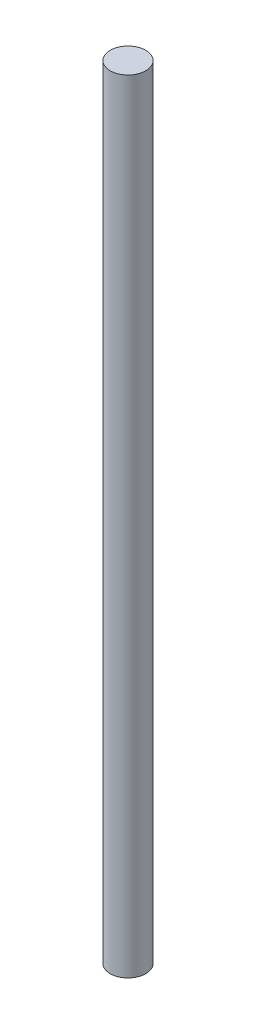
ISO-10303-21;
HEADER;
FILE_DESCRIPTION(('STEP AP214'),'2;1');
FILE_NAME('part.step','',(''),(''),'','','');
FILE_SCHEMA(('AUTOMOTIVE_DESIGN { 1 0 10303 214 1 1 1 1 }'));
ENDSEC;
DATA;
#1=APPLICATION_CONTEXT('core data for automotive mechanical design processes');
#2=APPLICATION_PROTOCOL_DEFINITION('international standard','automotive_design',2000,#1);
#3=PRODUCT_CONTEXT('',#1,'mechanical');
#4=PRODUCT('Part','Part','',(#3));
#5=PRODUCT_RELATED_PRODUCT_CATEGORY('part','',(#4));
#6=PRODUCT_DEFINITION_FORMATION('','',#4);
#7=PRODUCT_DEFINITION_CONTEXT('part definition',#1,'design');
#8=PRODUCT_DEFINITION('design','',#6,#7);
#9=PRODUCT_DEFINITION_SHAPE('','',#8);
#10=(LENGTH_UNIT() NAMED_UNIT(*) SI_UNIT(.MILLI.,.METRE.));
#11=(NAMED_UNIT(*) PLANE_ANGLE_UNIT() SI_UNIT($,.RADIAN.));
#12=(NAMED_UNIT(*) SI_UNIT($,.STERADIAN.) SOLID_ANGLE_UNIT());
#13=UNCERTAINTY_MEASURE_WITH_UNIT(LENGTH_MEASURE(1.E-05),#10,'distance_accuracy_value','');
#14=(GEOMETRIC_REPRESENTATION_CONTEXT(3) GLOBAL_UNCERTAINTY_ASSIGNED_CONTEXT((#13)) GLOBAL_UNIT_ASSIGNED_CONTEXT((#10,
#11,#12)) REPRESENTATION_CONTEXT('',''));
#15=CARTESIAN_POINT('',(0.,0.,0.));
#16=DIRECTION('',(0.,0.,1.));
#17=DIRECTION('',(1.,0.,0.));
#18=AXIS2_PLACEMENT_3D('',#15,#16,#17);
#19=CARTESIAN_POINT('',(0.,139.7,0.));
#20=DIRECTION('',(0.,-1.,0.));
#21=DIRECTION('',(0.,0.,-1.));
#22=AXIS2_PLACEMENT_3D('',#19,#20,#21);
#23=CYLINDRICAL_SURFACE('',#22,3.175);
#24=CARTESIAN_POINT('',(0.,139.7,0.));
#25=DIRECTION('',(0.,1.,0.));
#26=DIRECTION('',(0.,0.,1.));
#27=AXIS2_PLACEMENT_3D('',#24,#25,#26);
#28=CIRCLE('',#27,3.175);
#29=CARTESIAN_POINT('',(0.,139.7,3.175));
#30=VERTEX_POINT('',#29);
#31=EDGE_CURVE('E10',#30,#30,#28,.T.);
#32=ORIENTED_EDGE('',*,*,#31,.F.);
#33=EDGE_LOOP('',(#32));
#34=FACE_BOUND('',#33,.T.);
#35=CARTESIAN_POINT('',(0.,0.,0.));
#36=DIRECTION('',(0.,1.,0.));
#37=DIRECTION('',(0.,0.,1.));
#38=AXIS2_PLACEMENT_3D('',#35,#36,#37);
#39=CIRCLE('',#38,3.175);
#40=CARTESIAN_POINT('',(0.,0.,3.175));
#41=VERTEX_POINT('',#40);
#42=EDGE_CURVE('E40',#41,#41,#39,.T.);
#43=ORIENTED_EDGE('',*,*,#42,.T.);
#44=EDGE_LOOP('',(#43));
#45=FACE_BOUND('',#44,.T.);
#46=ADVANCED_FACE('F37',(#34,#45),#23,.T.);
#47=CARTESIAN_POINT('',(0.,139.7,0.));
#48=DIRECTION('',(0.,1.,0.));
#49=DIRECTION('',(0.,0.,1.));
#50=AXIS2_PLACEMENT_3D('',#47,#48,#49);
#51=PLANE('',#50);
#52=ORIENTED_EDGE('',*,*,#31,.T.);
#53=EDGE_LOOP('',(#52));
#54=FACE_BOUND('',#53,.T.);
#55=ADVANCED_FACE('F54',(#54),#51,.T.);
#56=CARTESIAN_POINT('',(0.,0.,0.));
#57=DIRECTION('',(0.,1.,0.));
#58=DIRECTION('',(0.,0.,1.));
#59=AXIS2_PLACEMENT_3D('',#56,#57,#58);
#60=PLANE('',#59);
#61=ORIENTED_EDGE('',*,*,#42,.F.);
#62=EDGE_LOOP('',(#61));
#63=FACE_BOUND('',#62,.T.);
#64=ADVANCED_FACE('F52',(#63),#60,.F.);
#65=CLOSED_SHELL('',(#46,#55,#64));
#66=MANIFOLD_SOLID_BREP('B2',#65);
#67=ADVANCED_BREP_SHAPE_REPRESENTATION('',(#18,#66),#14);
#68=SHAPE_DEFINITION_REPRESENTATION(#9,#67);
ENDSEC;
END-ISO-10303-21;
